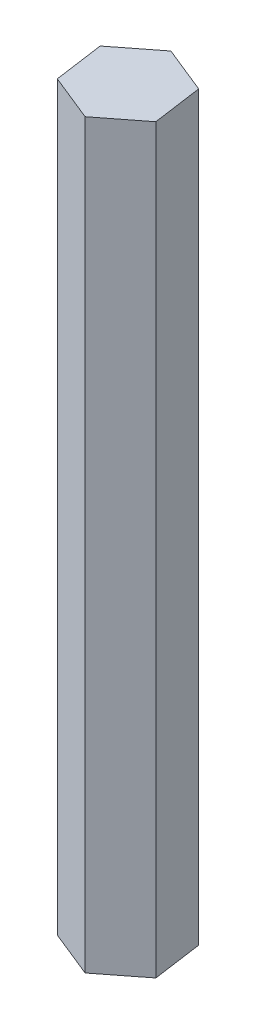
ISO-10303-21;
HEADER;
FILE_DESCRIPTION(('STEP AP214'),'2;1');
FILE_NAME('part.step','',(''),(''),'','','');
FILE_SCHEMA(('AUTOMOTIVE_DESIGN { 1 0 10303 214 1 1 1 1 }'));
ENDSEC;
DATA;
#1=APPLICATION_CONTEXT('core data for automotive mechanical design processes');
#2=APPLICATION_PROTOCOL_DEFINITION('international standard','automotive_design',2000,#1);
#3=PRODUCT_CONTEXT('',#1,'mechanical');
#4=PRODUCT('Part','Part','',(#3));
#5=PRODUCT_RELATED_PRODUCT_CATEGORY('part','',(#4));
#6=PRODUCT_DEFINITION_FORMATION('','',#4);
#7=PRODUCT_DEFINITION_CONTEXT('part definition',#1,'design');
#8=PRODUCT_DEFINITION('design','',#6,#7);
#9=PRODUCT_DEFINITION_SHAPE('','',#8);
#10=(LENGTH_UNIT() NAMED_UNIT(*) SI_UNIT(.MILLI.,.METRE.));
#11=(NAMED_UNIT(*) PLANE_ANGLE_UNIT() SI_UNIT($,.RADIAN.));
#12=(NAMED_UNIT(*) SI_UNIT($,.STERADIAN.) SOLID_ANGLE_UNIT());
#13=UNCERTAINTY_MEASURE_WITH_UNIT(LENGTH_MEASURE(1.E-05),#10,'distance_accuracy_value','');
#14=(GEOMETRIC_REPRESENTATION_CONTEXT(3) GLOBAL_UNCERTAINTY_ASSIGNED_CONTEXT((#13)) GLOBAL_UNIT_ASSIGNED_CONTEXT((#10,
#11,#12)) REPRESENTATION_CONTEXT('',''));
#15=CARTESIAN_POINT('',(0.,0.,0.));
#16=DIRECTION('',(0.,0.,1.));
#17=DIRECTION('',(1.,0.,0.));
#18=AXIS2_PLACEMENT_3D('',#15,#16,#17);
#19=CARTESIAN_POINT('',(6.79798509966573,107.95,2.747859515706));
#20=DIRECTION('',(-0.990290850089039,0.,0.139010906873986));
#21=DIRECTION('',(0.139010906873986,0.,0.990290850089039));
#22=AXIS2_PLACEMENT_3D('',#19,#20,#21);
#23=PLANE('',#22);
#24=DIRECTION('',(-0.139010906873986,0.,-0.990290850089039));
#25=VECTOR('',#24,1.);
#26=CARTESIAN_POINT('',(6.79798509966573,0.,2.747859515706));
#27=LINE('',#26,#25);
#28=CARTESIAN_POINT('',(6.79798509966573,0.,2.747859515706));
#29=VERTEX_POINT('',#28);
#30=CARTESIAN_POINT('',(5.77870869646507,0.,-4.51329803300562));
#31=VERTEX_POINT('',#30);
#32=EDGE_CURVE('E118',#29,#31,#27,.T.);
#33=ORIENTED_EDGE('',*,*,#32,.T.);
#34=DIRECTION('',(0.,-1.,0.));
#35=VECTOR('',#34,1.);
#36=CARTESIAN_POINT('',(5.77870869646507,107.95,-4.51329803300562));
#37=LINE('',#36,#35);
#38=CARTESIAN_POINT('',(5.77870869646507,107.95,-4.51329803300562));
#39=VERTEX_POINT('',#38);
#40=EDGE_CURVE('E11',#39,#31,#37,.T.);
#41=ORIENTED_EDGE('',*,*,#40,.F.);
#42=DIRECTION('',(-0.139010906873986,0.,-0.990290850089039));
#43=VECTOR('',#42,1.);
#44=CARTESIAN_POINT('',(6.79798509966573,107.95,2.747859515706));
#45=LINE('',#44,#43);
#46=CARTESIAN_POINT('',(6.79798509966573,107.95,2.747859515706));
#47=VERTEX_POINT('',#46);
#48=EDGE_CURVE('E128',#47,#39,#45,.T.);
#49=ORIENTED_EDGE('',*,*,#48,.F.);
#50=DIRECTION('',(0.,-1.,0.));
#51=VECTOR('',#50,1.);
#52=CARTESIAN_POINT('',(6.79798509966573,107.95,2.747859515706));
#53=LINE('',#52,#51);
#54=EDGE_CURVE('E114',#47,#29,#53,.T.);
#55=ORIENTED_EDGE('',*,*,#54,.T.);
#56=EDGE_LOOP('',(#33,#41,#49,#55));
#57=FACE_BOUND('',#56,.T.);
#58=ADVANCED_FACE('F34',(#57),#23,.F.);
#59=CARTESIAN_POINT('',(5.77870869646507,107.95,-4.51329803300562));
#60=DIRECTION('',(-0.374758448288535,0.,0.927122486749388));
#61=DIRECTION('',(0.927122486749388,0.,0.374758448288535));
#62=AXIS2_PLACEMENT_3D('',#59,#60,#61);
#63=PLANE('',#62);
#64=DIRECTION('',(-0.927122486749388,0.,-0.374758448288535));
#65=VECTOR('',#64,1.);
#66=CARTESIAN_POINT('',(5.77870869646507,0.,-4.51329803300562));
#67=LINE('',#66,#65);
#68=CARTESIAN_POINT('',(-1.01927640320067,0.,-7.26115754871161));
#69=VERTEX_POINT('',#68);
#70=EDGE_CURVE('E121',#31,#69,#67,.T.);
#71=ORIENTED_EDGE('',*,*,#70,.T.);
#72=DIRECTION('',(0.,-1.,0.));
#73=VECTOR('',#72,1.);
#74=CARTESIAN_POINT('',(-1.01927640320067,107.95,-7.26115754871161));
#75=LINE('',#74,#73);
#76=CARTESIAN_POINT('',(-1.01927640320067,107.95,-7.26115754871161));
#77=VERTEX_POINT('',#76);
#78=EDGE_CURVE('E42',#77,#69,#75,.T.);
#79=ORIENTED_EDGE('',*,*,#78,.F.);
#80=DIRECTION('',(-0.927122486749388,0.,-0.374758448288535));
#81=VECTOR('',#80,1.);
#82=CARTESIAN_POINT('',(5.77870869646507,107.95,-4.51329803300562));
#83=LINE('',#82,#81);
#84=EDGE_CURVE('E87',#39,#77,#83,.T.);
#85=ORIENTED_EDGE('',*,*,#84,.F.);
#86=ORIENTED_EDGE('',*,*,#40,.T.);
#87=EDGE_LOOP('',(#71,#79,#85,#86));
#88=FACE_BOUND('',#87,.T.);
#89=ADVANCED_FACE('F152',(#88),#63,.F.);
#90=CARTESIAN_POINT('',(-1.01927640320067,107.95,-7.26115754871161));
#91=DIRECTION('',(0.615532401800504,0.,0.788111579875402));
#92=DIRECTION('',(0.788111579875402,0.,-0.615532401800504));
#93=AXIS2_PLACEMENT_3D('',#90,#91,#92);
#94=PLANE('',#93);
#95=DIRECTION('',(-0.788111579875402,0.,0.615532401800504));
#96=VECTOR('',#95,1.);
#97=CARTESIAN_POINT('',(-1.01927640320067,0.,-7.26115754871161));
#98=LINE('',#97,#96);
#99=CARTESIAN_POINT('',(-6.79798509966573,0.,-2.747859515706));
#100=VERTEX_POINT('',#99);
#101=EDGE_CURVE('E123',#69,#100,#98,.T.);
#102=ORIENTED_EDGE('',*,*,#101,.T.);
#103=DIRECTION('',(0.,-1.,0.));
#104=VECTOR('',#103,1.);
#105=CARTESIAN_POINT('',(-6.79798509966573,107.95,-2.747859515706));
#106=LINE('',#105,#104);
#107=CARTESIAN_POINT('',(-6.79798509966573,107.95,-2.747859515706));
#108=VERTEX_POINT('',#107);
#109=EDGE_CURVE('E109',#108,#100,#106,.T.);
#110=ORIENTED_EDGE('',*,*,#109,.F.);
#111=DIRECTION('',(-0.788111579875402,0.,0.615532401800504));
#112=VECTOR('',#111,1.);
#113=CARTESIAN_POINT('',(-1.01927640320067,107.95,-7.26115754871161));
#114=LINE('',#113,#112);
#115=EDGE_CURVE('E100',#77,#108,#114,.T.);
#116=ORIENTED_EDGE('',*,*,#115,.F.);
#117=ORIENTED_EDGE('',*,*,#78,.T.);
#118=EDGE_LOOP('',(#102,#110,#116,#117));
#119=FACE_BOUND('',#118,.T.);
#120=ADVANCED_FACE('F134',(#119),#94,.F.);
#121=CARTESIAN_POINT('',(-6.79798509966573,107.95,-2.747859515706));
#122=DIRECTION('',(0.990290850089039,0.,-0.139010906873986));
#123=DIRECTION('',(-0.139010906873986,0.,-0.990290850089039));
#124=AXIS2_PLACEMENT_3D('',#121,#122,#123);
#125=PLANE('',#124);
#126=DIRECTION('',(0.139010906873986,0.,0.990290850089039));
#127=VECTOR('',#126,1.);
#128=CARTESIAN_POINT('',(-6.79798509966573,0.,-2.747859515706));
#129=LINE('',#128,#127);
#130=CARTESIAN_POINT('',(-5.77870869646506,0.,4.51329803300562));
#131=VERTEX_POINT('',#130);
#132=EDGE_CURVE('E108',#100,#131,#129,.T.);
#133=ORIENTED_EDGE('',*,*,#132,.T.);
#134=DIRECTION('',(0.,-1.,0.));
#135=VECTOR('',#134,1.);
#136=CARTESIAN_POINT('',(-5.77870869646506,107.95,4.51329803300562));
#137=LINE('',#136,#135);
#138=CARTESIAN_POINT('',(-5.77870869646506,107.95,4.51329803300562));
#139=VERTEX_POINT('',#138);
#140=EDGE_CURVE('E105',#139,#131,#137,.T.);
#141=ORIENTED_EDGE('',*,*,#140,.F.);
#142=DIRECTION('',(0.139010906873986,0.,0.990290850089039));
#143=VECTOR('',#142,1.);
#144=CARTESIAN_POINT('',(-6.79798509966573,107.95,-2.747859515706));
#145=LINE('',#144,#143);
#146=EDGE_CURVE('E94',#108,#139,#145,.T.);
#147=ORIENTED_EDGE('',*,*,#146,.F.);
#148=ORIENTED_EDGE('',*,*,#109,.T.);
#149=EDGE_LOOP('',(#133,#141,#147,#148));
#150=FACE_BOUND('',#149,.T.);
#151=ADVANCED_FACE('F106',(#150),#125,.F.);
#152=CARTESIAN_POINT('',(-5.77870869646506,107.95,4.51329803300562));
#153=DIRECTION('',(0.374758448288535,0.,-0.927122486749388));
#154=DIRECTION('',(-0.927122486749388,0.,-0.374758448288535));
#155=AXIS2_PLACEMENT_3D('',#152,#153,#154);
#156=PLANE('',#155);
#157=DIRECTION('',(0.927122486749388,0.,0.374758448288535));
#158=VECTOR('',#157,1.);
#159=CARTESIAN_POINT('',(-5.77870869646506,0.,4.51329803300562));
#160=LINE('',#159,#158);
#161=CARTESIAN_POINT('',(1.01927640320067,0.,7.26115754871161));
#162=VERTEX_POINT('',#161);
#163=EDGE_CURVE('E73',#131,#162,#160,.T.);
#164=ORIENTED_EDGE('',*,*,#163,.T.);
#165=DIRECTION('',(0.,-1.,0.));
#166=VECTOR('',#165,1.);
#167=CARTESIAN_POINT('',(1.01927640320067,107.95,7.26115754871161));
#168=LINE('',#167,#166);
#169=CARTESIAN_POINT('',(1.01927640320067,107.95,7.26115754871161));
#170=VERTEX_POINT('',#169);
#171=EDGE_CURVE('E110',#170,#162,#168,.T.);
#172=ORIENTED_EDGE('',*,*,#171,.F.);
#173=DIRECTION('',(0.927122486749388,0.,0.374758448288535));
#174=VECTOR('',#173,1.);
#175=CARTESIAN_POINT('',(-5.77870869646506,107.95,4.51329803300562));
#176=LINE('',#175,#174);
#177=EDGE_CURVE('E98',#139,#170,#176,.T.);
#178=ORIENTED_EDGE('',*,*,#177,.F.);
#179=ORIENTED_EDGE('',*,*,#140,.T.);
#180=EDGE_LOOP('',(#164,#172,#178,#179));
#181=FACE_BOUND('',#180,.T.);
#182=ADVANCED_FACE('F112',(#181),#156,.F.);
#183=CARTESIAN_POINT('',(1.01927640320067,107.95,7.26115754871161));
#184=DIRECTION('',(-0.615532401800504,0.,-0.788111579875402));
#185=DIRECTION('',(-0.788111579875402,0.,0.615532401800504));
#186=AXIS2_PLACEMENT_3D('',#183,#184,#185);
#187=PLANE('',#186);
#188=DIRECTION('',(0.788111579875402,0.,-0.615532401800504));
#189=VECTOR('',#188,1.);
#190=CARTESIAN_POINT('',(1.01927640320067,0.,7.26115754871161));
#191=LINE('',#190,#189);
#192=EDGE_CURVE('E79',#162,#29,#191,.T.);
#193=ORIENTED_EDGE('',*,*,#192,.T.);
#194=ORIENTED_EDGE('',*,*,#54,.F.);
#195=DIRECTION('',(0.788111579875402,0.,-0.615532401800504));
#196=VECTOR('',#195,1.);
#197=CARTESIAN_POINT('',(1.01927640320067,107.95,7.26115754871161));
#198=LINE('',#197,#196);
#199=EDGE_CURVE('E50',#170,#47,#198,.T.);
#200=ORIENTED_EDGE('',*,*,#199,.F.);
#201=ORIENTED_EDGE('',*,*,#171,.T.);
#202=EDGE_LOOP('',(#193,#194,#200,#201));
#203=FACE_BOUND('',#202,.T.);
#204=ADVANCED_FACE('F141',(#203),#187,.F.);
#205=CARTESIAN_POINT('',(0.,107.95,0.));
#206=DIRECTION('',(0.,1.,0.));
#207=DIRECTION('',(0.,0.,1.));
#208=AXIS2_PLACEMENT_3D('',#205,#206,#207);
#209=PLANE('',#208);
#210=ORIENTED_EDGE('',*,*,#48,.T.);
#211=ORIENTED_EDGE('',*,*,#84,.T.);
#212=ORIENTED_EDGE('',*,*,#115,.T.);
#213=ORIENTED_EDGE('',*,*,#146,.T.);
#214=ORIENTED_EDGE('',*,*,#177,.T.);
#215=ORIENTED_EDGE('',*,*,#199,.T.);
#216=EDGE_LOOP('',(#210,#211,#212,#213,#214,#215));
#217=FACE_BOUND('',#216,.T.);
#218=ADVANCED_FACE('F96',(#217),#209,.T.);
#219=CARTESIAN_POINT('',(0.,0.,0.));
#220=DIRECTION('',(0.,1.,0.));
#221=DIRECTION('',(0.,0.,1.));
#222=AXIS2_PLACEMENT_3D('',#219,#220,#221);
#223=PLANE('',#222);
#224=ORIENTED_EDGE('',*,*,#32,.F.);
#225=ORIENTED_EDGE('',*,*,#192,.F.);
#226=ORIENTED_EDGE('',*,*,#163,.F.);
#227=ORIENTED_EDGE('',*,*,#132,.F.);
#228=ORIENTED_EDGE('',*,*,#101,.F.);
#229=ORIENTED_EDGE('',*,*,#70,.F.);
#230=EDGE_LOOP('',(#224,#225,#226,#227,#228,#229));
#231=FACE_BOUND('',#230,.T.);
#232=ADVANCED_FACE('F137',(#231),#223,.F.);
#233=CLOSED_SHELL('',(#58,#89,#120,#151,#182,#204,#218,#232));
#234=MANIFOLD_SOLID_BREP('B2',#233);
#235=ADVANCED_BREP_SHAPE_REPRESENTATION('',(#18,#234),#14);
#236=SHAPE_DEFINITION_REPRESENTATION(#9,#235);
ENDSEC;
END-ISO-10303-21;
